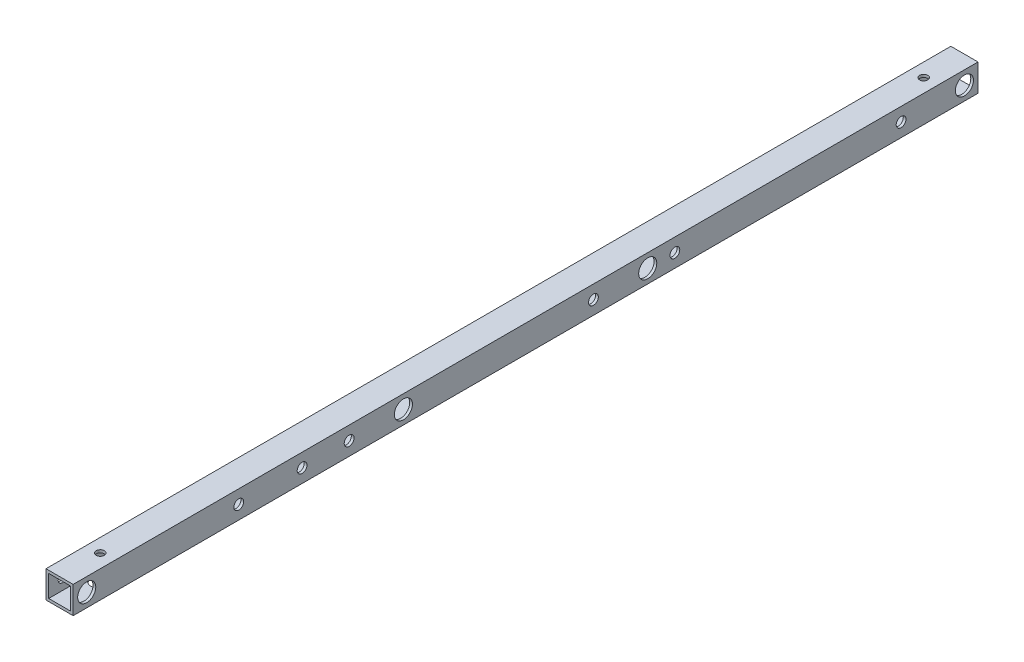
ISO-10303-21;
HEADER;
FILE_DESCRIPTION(('STEP AP214'),'2;1');
FILE_NAME('part.step','',(''),(''),'','','');
FILE_SCHEMA(('AUTOMOTIVE_DESIGN { 1 0 10303 214 1 1 1 1 }'));
ENDSEC;
DATA;
#1=APPLICATION_CONTEXT('core data for automotive mechanical design processes');
#2=APPLICATION_PROTOCOL_DEFINITION('international standard','automotive_design',2000,#1);
#3=PRODUCT_CONTEXT('',#1,'mechanical');
#4=PRODUCT('Part','Part','',(#3));
#5=PRODUCT_RELATED_PRODUCT_CATEGORY('part','',(#4));
#6=PRODUCT_DEFINITION_FORMATION('','',#4);
#7=PRODUCT_DEFINITION_CONTEXT('part definition',#1,'design');
#8=PRODUCT_DEFINITION('design','',#6,#7);
#9=PRODUCT_DEFINITION_SHAPE('','',#8);
#10=(LENGTH_UNIT() NAMED_UNIT(*) SI_UNIT(.MILLI.,.METRE.));
#11=(NAMED_UNIT(*) PLANE_ANGLE_UNIT() SI_UNIT($,.RADIAN.));
#12=(NAMED_UNIT(*) SI_UNIT($,.STERADIAN.) SOLID_ANGLE_UNIT());
#13=UNCERTAINTY_MEASURE_WITH_UNIT(LENGTH_MEASURE(1.E-05),#10,'distance_accuracy_value','');
#14=(GEOMETRIC_REPRESENTATION_CONTEXT(3) GLOBAL_UNCERTAINTY_ASSIGNED_CONTEXT((#13)) GLOBAL_UNIT_ASSIGNED_CONTEXT((#10,
#11,#12)) REPRESENTATION_CONTEXT('',''));
#15=CARTESIAN_POINT('',(0.,0.,0.));
#16=DIRECTION('',(0.,0.,1.));
#17=DIRECTION('',(1.,0.,0.));
#18=AXIS2_PLACEMENT_3D('',#15,#16,#17);
#19=CARTESIAN_POINT('',(-6.,-6.,500.));
#20=DIRECTION('',(1.,0.,0.));
#21=DIRECTION('',(0.,0.,-1.));
#22=AXIS2_PLACEMENT_3D('',#19,#20,#21);
#23=PLANE('',#22);
#24=CARTESIAN_POINT('',(-6.,0.,212.5));
#25=DIRECTION('',(1.,0.,0.));
#26=DIRECTION('',(0.,0.,-1.));
#27=AXIS2_PLACEMENT_3D('',#24,#25,#26);
#28=CIRCLE('',#27,4.99999999999999);
#29=CARTESIAN_POINT('',(-6.,0.,207.5));
#30=VERTEX_POINT('',#29);
#31=EDGE_CURVE('E691',#30,#30,#28,.F.);
#32=ORIENTED_EDGE('',*,*,#31,.T.);
#33=EDGE_LOOP('',(#32));
#34=FACE_BOUND('',#33,.T.);
#35=DIRECTION('',(0.,-1.,0.));
#36=VECTOR('',#35,1.);
#37=CARTESIAN_POINT('',(-6.,-6.,0.));
#38=LINE('',#37,#36);
#39=CARTESIAN_POINT('',(-6.,6.,0.));
#40=VERTEX_POINT('',#39);
#41=CARTESIAN_POINT('',(-6.,-6.,0.));
#42=VERTEX_POINT('',#41);
#43=EDGE_CURVE('E150',#40,#42,#38,.T.);
#44=ORIENTED_EDGE('',*,*,#43,.F.);
#45=DIRECTION('',(0.,0.,-1.));
#46=VECTOR('',#45,1.);
#47=CARTESIAN_POINT('',(-6.,6.,500.));
#48=LINE('',#47,#46);
#49=CARTESIAN_POINT('',(-6.,6.,500.));
#50=VERTEX_POINT('',#49);
#51=EDGE_CURVE('E130',#50,#40,#48,.T.);
#52=ORIENTED_EDGE('',*,*,#51,.F.);
#53=DIRECTION('',(0.,-1.,0.));
#54=VECTOR('',#53,1.);
#55=CARTESIAN_POINT('',(-6.,-6.,500.));
#56=LINE('',#55,#54);
#57=CARTESIAN_POINT('',(-6.,-6.,500.));
#58=VERTEX_POINT('',#57);
#59=EDGE_CURVE('E134',#50,#58,#56,.T.);
#60=ORIENTED_EDGE('',*,*,#59,.T.);
#61=DIRECTION('',(0.,0.,-1.));
#62=VECTOR('',#61,1.);
#63=CARTESIAN_POINT('',(-6.,-6.,500.));
#64=LINE('',#63,#62);
#65=EDGE_CURVE('E61',#58,#42,#64,.T.);
#66=ORIENTED_EDGE('',*,*,#65,.T.);
#67=EDGE_LOOP('',(#44,#52,#60,#66));
#68=FACE_BOUND('',#67,.T.);
#69=CARTESIAN_POINT('',(-6.,0.,7.5));
#70=DIRECTION('',(1.,0.,0.));
#71=DIRECTION('',(0.,0.,-1.));
#72=AXIS2_PLACEMENT_3D('',#69,#70,#71);
#73=CIRCLE('',#72,2.25);
#74=CARTESIAN_POINT('',(-6.,0.,5.25));
#75=VERTEX_POINT('',#74);
#76=EDGE_CURVE('E199',#75,#75,#73,.T.);
#77=ORIENTED_EDGE('',*,*,#76,.F.);
#78=EDGE_LOOP('',(#77));
#79=FACE_BOUND('',#78,.T.);
#80=CARTESIAN_POINT('',(-6.,0.,182.5));
#81=DIRECTION('',(1.,0.,0.));
#82=DIRECTION('',(0.,0.,-1.));
#83=AXIS2_PLACEMENT_3D('',#80,#81,#82);
#84=CIRCLE('',#83,2.25000000000001);
#85=CARTESIAN_POINT('',(-6.,0.,180.25));
#86=VERTEX_POINT('',#85);
#87=EDGE_CURVE('E205',#86,#86,#84,.T.);
#88=ORIENTED_EDGE('',*,*,#87,.F.);
#89=EDGE_LOOP('',(#88));
#90=FACE_BOUND('',#89,.T.);
#91=CARTESIAN_POINT('',(-6.,0.,317.5));
#92=DIRECTION('',(1.,0.,0.));
#93=DIRECTION('',(0.,0.,-1.));
#94=AXIS2_PLACEMENT_3D('',#91,#92,#93);
#95=CIRCLE('',#94,2.24999999999995);
#96=CARTESIAN_POINT('',(-6.,0.,315.25));
#97=VERTEX_POINT('',#96);
#98=EDGE_CURVE('E210',#97,#97,#95,.T.);
#99=ORIENTED_EDGE('',*,*,#98,.F.);
#100=EDGE_LOOP('',(#99));
#101=FACE_BOUND('',#100,.T.);
#102=CARTESIAN_POINT('',(-6.,0.,492.5));
#103=DIRECTION('',(1.,0.,0.));
#104=DIRECTION('',(0.,0.,-1.));
#105=AXIS2_PLACEMENT_3D('',#102,#103,#104);
#106=CIRCLE('',#105,2.24999999999995);
#107=CARTESIAN_POINT('',(-6.,0.,490.25));
#108=VERTEX_POINT('',#107);
#109=EDGE_CURVE('E215',#108,#108,#106,.T.);
#110=ORIENTED_EDGE('',*,*,#109,.F.);
#111=EDGE_LOOP('',(#110));
#112=FACE_BOUND('',#111,.T.);
#113=CARTESIAN_POINT('',(-6.,0.,408.5));
#114=DIRECTION('',(1.,0.,0.));
#115=DIRECTION('',(0.,0.,-1.));
#116=AXIS2_PLACEMENT_3D('',#113,#114,#115);
#117=CIRCLE('',#116,4.99999999999999);
#118=CARTESIAN_POINT('',(-6.,0.,403.5));
#119=VERTEX_POINT('',#118);
#120=EDGE_CURVE('E722',#119,#119,#117,.F.);
#121=ORIENTED_EDGE('',*,*,#120,.T.);
#122=EDGE_LOOP('',(#121));
#123=FACE_BOUND('',#122,.T.);
#124=CARTESIAN_POINT('',(-6.,0.,373.5));
#125=DIRECTION('',(1.,0.,0.));
#126=DIRECTION('',(0.,0.,-1.));
#127=AXIS2_PLACEMENT_3D('',#124,#125,#126);
#128=CIRCLE('',#127,4.99999999999999);
#129=CARTESIAN_POINT('',(-6.,0.,368.5));
#130=VERTEX_POINT('',#129);
#131=EDGE_CURVE('E714',#130,#130,#128,.F.);
#132=ORIENTED_EDGE('',*,*,#131,.T.);
#133=EDGE_LOOP('',(#132));
#134=FACE_BOUND('',#133,.T.);
#135=CARTESIAN_POINT('',(-6.,0.,42.5));
#136=DIRECTION('',(1.,0.,0.));
#137=DIRECTION('',(0.,0.,-1.));
#138=AXIS2_PLACEMENT_3D('',#135,#136,#137);
#139=CIRCLE('',#138,4.99999999999999);
#140=CARTESIAN_POINT('',(-6.,0.,37.5));
#141=VERTEX_POINT('',#140);
#142=EDGE_CURVE('E706',#141,#141,#139,.F.);
#143=ORIENTED_EDGE('',*,*,#142,.T.);
#144=EDGE_LOOP('',(#143));
#145=FACE_BOUND('',#144,.T.);
#146=CARTESIAN_POINT('',(-6.,0.,167.5));
#147=DIRECTION('',(1.,0.,0.));
#148=DIRECTION('',(0.,0.,-1.));
#149=AXIS2_PLACEMENT_3D('',#146,#147,#148);
#150=CIRCLE('',#149,4.99999999999999);
#151=CARTESIAN_POINT('',(-6.,0.,162.5));
#152=VERTEX_POINT('',#151);
#153=EDGE_CURVE('E698',#152,#152,#150,.F.);
#154=ORIENTED_EDGE('',*,*,#153,.T.);
#155=EDGE_LOOP('',(#154));
#156=FACE_BOUND('',#155,.T.);
#157=CARTESIAN_POINT('',(-6.,0.,347.5));
#158=DIRECTION('',(1.,0.,0.));
#159=DIRECTION('',(0.,0.,-1.));
#160=AXIS2_PLACEMENT_3D('',#157,#158,#159);
#161=CIRCLE('',#160,4.99999999999999);
#162=CARTESIAN_POINT('',(-6.,0.,342.5));
#163=VERTEX_POINT('',#162);
#164=EDGE_CURVE('E677',#163,#163,#161,.F.);
#165=ORIENTED_EDGE('',*,*,#164,.T.);
#166=EDGE_LOOP('',(#165));
#167=FACE_BOUND('',#166,.T.);
#168=ADVANCED_FACE('F43',(#34,#68,#79,#90,#101,#112,#123,#134,#145,#156,#167),#23,.T.);
#169=CARTESIAN_POINT('',(0.,0.,500.));
#170=DIRECTION('',(0.,0.,-1.));
#171=DIRECTION('',(-1.,0.,0.));
#172=AXIS2_PLACEMENT_3D('',#169,#170,#171);
#173=PLANE('',#172);
#174=DIRECTION('',(0.,1.,0.));
#175=VECTOR('',#174,1.);
#176=CARTESIAN_POINT('',(7.5,-7.5,500.));
#177=LINE('',#176,#175);
#178=CARTESIAN_POINT('',(7.5,-7.5,500.));
#179=VERTEX_POINT('',#178);
#180=CARTESIAN_POINT('',(7.5,7.5,500.));
#181=VERTEX_POINT('',#180);
#182=EDGE_CURVE('E163',#179,#181,#177,.T.);
#183=ORIENTED_EDGE('',*,*,#182,.T.);
#184=DIRECTION('',(-1.,0.,0.));
#185=VECTOR('',#184,1.);
#186=CARTESIAN_POINT('',(-7.5,7.5,500.));
#187=LINE('',#186,#185);
#188=CARTESIAN_POINT('',(-7.5,7.5,500.));
#189=VERTEX_POINT('',#188);
#190=EDGE_CURVE('E167',#181,#189,#187,.T.);
#191=ORIENTED_EDGE('',*,*,#190,.T.);
#192=DIRECTION('',(0.,-1.,0.));
#193=VECTOR('',#192,1.);
#194=CARTESIAN_POINT('',(-7.5,-7.5,500.));
#195=LINE('',#194,#193);
#196=CARTESIAN_POINT('',(-7.5,-7.5,500.));
#197=VERTEX_POINT('',#196);
#198=EDGE_CURVE('E171',#189,#197,#195,.T.);
#199=ORIENTED_EDGE('',*,*,#198,.T.);
#200=DIRECTION('',(1.,0.,0.));
#201=VECTOR('',#200,1.);
#202=CARTESIAN_POINT('',(-7.5,-7.5,500.));
#203=LINE('',#202,#201);
#204=EDGE_CURVE('E174',#197,#179,#203,.T.);
#205=ORIENTED_EDGE('',*,*,#204,.T.);
#206=EDGE_LOOP('',(#183,#191,#199,#205));
#207=FACE_BOUND('',#206,.T.);
#208=DIRECTION('',(0.,1.,0.));
#209=VECTOR('',#208,1.);
#210=CARTESIAN_POINT('',(6.,-6.,500.));
#211=LINE('',#210,#209);
#212=CARTESIAN_POINT('',(6.,-6.,500.));
#213=VERTEX_POINT('',#212);
#214=CARTESIAN_POINT('',(6.,6.,500.));
#215=VERTEX_POINT('',#214);
#216=EDGE_CURVE('E111',#213,#215,#211,.T.);
#217=ORIENTED_EDGE('',*,*,#216,.F.);
#218=DIRECTION('',(1.,0.,0.));
#219=VECTOR('',#218,1.);
#220=CARTESIAN_POINT('',(-6.,-6.,500.));
#221=LINE('',#220,#219);
#222=EDGE_CURVE('E139',#58,#213,#221,.T.);
#223=ORIENTED_EDGE('',*,*,#222,.F.);
#224=ORIENTED_EDGE('',*,*,#59,.F.);
#225=DIRECTION('',(-1.,0.,0.));
#226=VECTOR('',#225,1.);
#227=CARTESIAN_POINT('',(-6.,6.,500.));
#228=LINE('',#227,#226);
#229=EDGE_CURVE('E120',#215,#50,#228,.T.);
#230=ORIENTED_EDGE('',*,*,#229,.F.);
#231=EDGE_LOOP('',(#217,#223,#224,#230));
#232=FACE_BOUND('',#231,.T.);
#233=ADVANCED_FACE('F133',(#207,#232),#173,.F.);
#234=CARTESIAN_POINT('',(0.,0.,0.));
#235=DIRECTION('',(0.,0.,-1.));
#236=DIRECTION('',(-1.,0.,0.));
#237=AXIS2_PLACEMENT_3D('',#234,#235,#236);
#238=PLANE('',#237);
#239=DIRECTION('',(0.,1.,0.));
#240=VECTOR('',#239,1.);
#241=CARTESIAN_POINT('',(7.5,-7.5,0.));
#242=LINE('',#241,#240);
#243=CARTESIAN_POINT('',(7.5,-7.5,0.));
#244=VERTEX_POINT('',#243);
#245=CARTESIAN_POINT('',(7.5,7.5,0.));
#246=VERTEX_POINT('',#245);
#247=EDGE_CURVE('E129',#244,#246,#242,.T.);
#248=ORIENTED_EDGE('',*,*,#247,.F.);
#249=DIRECTION('',(1.,0.,0.));
#250=VECTOR('',#249,1.);
#251=CARTESIAN_POINT('',(-7.5,-7.5,0.));
#252=LINE('',#251,#250);
#253=CARTESIAN_POINT('',(-7.5,-7.5,0.));
#254=VERTEX_POINT('',#253);
#255=EDGE_CURVE('E168',#254,#244,#252,.T.);
#256=ORIENTED_EDGE('',*,*,#255,.F.);
#257=DIRECTION('',(0.,-1.,0.));
#258=VECTOR('',#257,1.);
#259=CARTESIAN_POINT('',(-7.5,-7.5,0.));
#260=LINE('',#259,#258);
#261=CARTESIAN_POINT('',(-7.5,7.5,0.));
#262=VERTEX_POINT('',#261);
#263=EDGE_CURVE('E184',#262,#254,#260,.T.);
#264=ORIENTED_EDGE('',*,*,#263,.F.);
#265=DIRECTION('',(-1.,0.,0.));
#266=VECTOR('',#265,1.);
#267=CARTESIAN_POINT('',(-7.5,7.5,0.));
#268=LINE('',#267,#266);
#269=EDGE_CURVE('E181',#246,#262,#268,.T.);
#270=ORIENTED_EDGE('',*,*,#269,.F.);
#271=EDGE_LOOP('',(#248,#256,#264,#270));
#272=FACE_BOUND('',#271,.T.);
#273=DIRECTION('',(1.,0.,0.));
#274=VECTOR('',#273,1.);
#275=CARTESIAN_POINT('',(-6.,-6.,0.));
#276=LINE('',#275,#274);
#277=CARTESIAN_POINT('',(6.,-6.,0.));
#278=VERTEX_POINT('',#277);
#279=EDGE_CURVE('E121',#42,#278,#276,.T.);
#280=ORIENTED_EDGE('',*,*,#279,.T.);
#281=DIRECTION('',(0.,1.,0.));
#282=VECTOR('',#281,1.);
#283=CARTESIAN_POINT('',(6.,-6.,0.));
#284=LINE('',#283,#282);
#285=CARTESIAN_POINT('',(6.,6.,0.));
#286=VERTEX_POINT('',#285);
#287=EDGE_CURVE('E69',#278,#286,#284,.T.);
#288=ORIENTED_EDGE('',*,*,#287,.T.);
#289=DIRECTION('',(-1.,0.,0.));
#290=VECTOR('',#289,1.);
#291=CARTESIAN_POINT('',(-6.,6.,0.));
#292=LINE('',#291,#290);
#293=EDGE_CURVE('E127',#286,#40,#292,.T.);
#294=ORIENTED_EDGE('',*,*,#293,.T.);
#295=ORIENTED_EDGE('',*,*,#43,.T.);
#296=EDGE_LOOP('',(#280,#288,#294,#295));
#297=FACE_BOUND('',#296,.T.);
#298=ADVANCED_FACE('F366',(#272,#297),#238,.T.);
#299=CARTESIAN_POINT('',(7.5,-7.5,500.));
#300=DIRECTION('',(-1.,0.,0.));
#301=DIRECTION('',(0.,0.,1.));
#302=AXIS2_PLACEMENT_3D('',#299,#300,#301);
#303=PLANE('',#302);
#304=CARTESIAN_POINT('',(7.5,0.,347.5));
#305=DIRECTION('',(1.,0.,0.));
#306=DIRECTION('',(0.,0.,-1.));
#307=AXIS2_PLACEMENT_3D('',#304,#305,#306);
#308=CIRCLE('',#307,2.7);
#309=CARTESIAN_POINT('',(7.5,0.,344.8));
#310=VERTEX_POINT('',#309);
#311=EDGE_CURVE('E726',#310,#310,#308,.T.);
#312=ORIENTED_EDGE('',*,*,#311,.F.);
#313=EDGE_LOOP('',(#312));
#314=FACE_BOUND('',#313,.T.);
#315=CARTESIAN_POINT('',(7.5,0.,212.5));
#316=DIRECTION('',(1.,0.,0.));
#317=DIRECTION('',(0.,0.,-1.));
#318=AXIS2_PLACEMENT_3D('',#315,#316,#317);
#319=CIRCLE('',#318,2.7);
#320=CARTESIAN_POINT('',(7.5,0.,209.8));
#321=VERTEX_POINT('',#320);
#322=EDGE_CURVE('E267',#321,#321,#319,.T.);
#323=ORIENTED_EDGE('',*,*,#322,.F.);
#324=EDGE_LOOP('',(#323));
#325=FACE_BOUND('',#324,.T.);
#326=CARTESIAN_POINT('',(7.5,0.,167.5));
#327=DIRECTION('',(1.,0.,0.));
#328=DIRECTION('',(0.,0.,-1.));
#329=AXIS2_PLACEMENT_3D('',#326,#327,#328);
#330=CIRCLE('',#329,2.7);
#331=CARTESIAN_POINT('',(7.5,0.,164.8));
#332=VERTEX_POINT('',#331);
#333=EDGE_CURVE('E250',#332,#332,#330,.T.);
#334=ORIENTED_EDGE('',*,*,#333,.F.);
#335=EDGE_LOOP('',(#334));
#336=FACE_BOUND('',#335,.T.);
#337=CARTESIAN_POINT('',(7.5,0.,42.5));
#338=DIRECTION('',(1.,0.,0.));
#339=DIRECTION('',(0.,0.,-1.));
#340=AXIS2_PLACEMENT_3D('',#337,#338,#339);
#341=CIRCLE('',#340,2.7);
#342=CARTESIAN_POINT('',(7.5,0.,39.8));
#343=VERTEX_POINT('',#342);
#344=EDGE_CURVE('E249',#343,#343,#341,.T.);
#345=ORIENTED_EDGE('',*,*,#344,.F.);
#346=EDGE_LOOP('',(#345));
#347=FACE_BOUND('',#346,.T.);
#348=CARTESIAN_POINT('',(7.5,0.,373.5));
#349=DIRECTION('',(1.,0.,0.));
#350=DIRECTION('',(0.,0.,-1.));
#351=AXIS2_PLACEMENT_3D('',#348,#349,#350);
#352=CIRCLE('',#351,2.7);
#353=CARTESIAN_POINT('',(7.5,0.,370.8));
#354=VERTEX_POINT('',#353);
#355=EDGE_CURVE('E274',#354,#354,#352,.T.);
#356=ORIENTED_EDGE('',*,*,#355,.F.);
#357=EDGE_LOOP('',(#356));
#358=FACE_BOUND('',#357,.T.);
#359=CARTESIAN_POINT('',(7.5,0.,408.5));
#360=DIRECTION('',(1.,0.,0.));
#361=DIRECTION('',(0.,0.,-1.));
#362=AXIS2_PLACEMENT_3D('',#359,#360,#361);
#363=CIRCLE('',#362,2.7);
#364=CARTESIAN_POINT('',(7.5,0.,405.8));
#365=VERTEX_POINT('',#364);
#366=EDGE_CURVE('E282',#365,#365,#363,.T.);
#367=ORIENTED_EDGE('',*,*,#366,.F.);
#368=EDGE_LOOP('',(#367));
#369=FACE_BOUND('',#368,.T.);
#370=CARTESIAN_POINT('',(7.5,0.,492.5));
#371=DIRECTION('',(1.,0.,0.));
#372=DIRECTION('',(0.,0.,-1.));
#373=AXIS2_PLACEMENT_3D('',#370,#371,#372);
#374=CIRCLE('',#373,4.99999999999999);
#375=CARTESIAN_POINT('',(7.5,0.,487.5));
#376=VERTEX_POINT('',#375);
#377=EDGE_CURVE('E224',#376,#376,#374,.T.);
#378=ORIENTED_EDGE('',*,*,#377,.F.);
#379=EDGE_LOOP('',(#378));
#380=FACE_BOUND('',#379,.T.);
#381=CARTESIAN_POINT('',(7.5,0.,7.5));
#382=DIRECTION('',(1.,0.,0.));
#383=DIRECTION('',(0.,0.,-1.));
#384=AXIS2_PLACEMENT_3D('',#381,#382,#383);
#385=CIRCLE('',#384,5.);
#386=CARTESIAN_POINT('',(7.5,0.,2.5));
#387=VERTEX_POINT('',#386);
#388=EDGE_CURVE('E300',#387,#387,#385,.T.);
#389=ORIENTED_EDGE('',*,*,#388,.F.);
#390=EDGE_LOOP('',(#389));
#391=FACE_BOUND('',#390,.T.);
#392=CARTESIAN_POINT('',(7.5,0.,182.5));
#393=DIRECTION('',(1.,0.,0.));
#394=DIRECTION('',(0.,0.,-1.));
#395=AXIS2_PLACEMENT_3D('',#392,#393,#394);
#396=CIRCLE('',#395,4.99999999999999);
#397=CARTESIAN_POINT('',(7.5,0.,177.5));
#398=VERTEX_POINT('',#397);
#399=EDGE_CURVE('E304',#398,#398,#396,.T.);
#400=ORIENTED_EDGE('',*,*,#399,.F.);
#401=EDGE_LOOP('',(#400));
#402=FACE_BOUND('',#401,.T.);
#403=CARTESIAN_POINT('',(7.5,0.,317.5));
#404=DIRECTION('',(1.,0.,0.));
#405=DIRECTION('',(0.,0.,-1.));
#406=AXIS2_PLACEMENT_3D('',#403,#404,#405);
#407=CIRCLE('',#406,4.99999999999999);
#408=CARTESIAN_POINT('',(7.5,0.,312.5));
#409=VERTEX_POINT('',#408);
#410=EDGE_CURVE('E245',#409,#409,#407,.T.);
#411=ORIENTED_EDGE('',*,*,#410,.F.);
#412=EDGE_LOOP('',(#411));
#413=FACE_BOUND('',#412,.T.);
#414=ORIENTED_EDGE('',*,*,#247,.T.);
#415=DIRECTION('',(0.,0.,-1.));
#416=VECTOR('',#415,1.);
#417=CARTESIAN_POINT('',(7.5,7.5,500.));
#418=LINE('',#417,#416);
#419=EDGE_CURVE('E11',#181,#246,#418,.T.);
#420=ORIENTED_EDGE('',*,*,#419,.F.);
#421=ORIENTED_EDGE('',*,*,#182,.F.);
#422=DIRECTION('',(0.,0.,-1.));
#423=VECTOR('',#422,1.);
#424=CARTESIAN_POINT('',(7.5,-7.5,500.));
#425=LINE('',#424,#423);
#426=EDGE_CURVE('E177',#179,#244,#425,.T.);
#427=ORIENTED_EDGE('',*,*,#426,.T.);
#428=EDGE_LOOP('',(#414,#420,#421,#427));
#429=FACE_BOUND('',#428,.T.);
#430=ADVANCED_FACE('F45',(#314,#325,#336,#347,#358,#369,#380,#391,#402,#413,#429),#303,.F.);
#431=CARTESIAN_POINT('',(-7.5,7.5,500.));
#432=DIRECTION('',(0.,-1.,0.));
#433=DIRECTION('',(0.,0.,-1.));
#434=AXIS2_PLACEMENT_3D('',#431,#432,#433);
#435=PLANE('',#434);
#436=CARTESIAN_POINT('',(9.26342336171615E-13,7.5,22.5));
#437=DIRECTION('',(0.,-1.,0.));
#438=DIRECTION('',(0.,0.,-1.));
#439=AXIS2_PLACEMENT_3D('',#436,#437,#438);
#440=CIRCLE('',#439,2.25);
#441=CARTESIAN_POINT('',(9.26342336171615E-13,7.5,20.25));
#442=VERTEX_POINT('',#441);
#443=EDGE_CURVE('E204',#442,#442,#440,.T.);
#444=ORIENTED_EDGE('',*,*,#443,.T.);
#445=EDGE_LOOP('',(#444));
#446=FACE_BOUND('',#445,.T.);
#447=CARTESIAN_POINT('',(0.,7.5,477.5));
#448=DIRECTION('',(0.,-1.,0.));
#449=DIRECTION('',(0.,0.,-1.));
#450=AXIS2_PLACEMENT_3D('',#447,#448,#449);
#451=CIRCLE('',#450,2.25);
#452=CARTESIAN_POINT('',(0.,7.5,475.25));
#453=VERTEX_POINT('',#452);
#454=EDGE_CURVE('E314',#453,#453,#451,.T.);
#455=ORIENTED_EDGE('',*,*,#454,.T.);
#456=EDGE_LOOP('',(#455));
#457=FACE_BOUND('',#456,.T.);
#458=ORIENTED_EDGE('',*,*,#269,.T.);
#459=DIRECTION('',(0.,0.,-1.));
#460=VECTOR('',#459,1.);
#461=CARTESIAN_POINT('',(-7.5,7.5,500.));
#462=LINE('',#461,#460);
#463=EDGE_CURVE('E53',#189,#262,#462,.T.);
#464=ORIENTED_EDGE('',*,*,#463,.F.);
#465=ORIENTED_EDGE('',*,*,#190,.F.);
#466=ORIENTED_EDGE('',*,*,#419,.T.);
#467=EDGE_LOOP('',(#458,#464,#465,#466));
#468=FACE_BOUND('',#467,.T.);
#469=ADVANCED_FACE('F388',(#446,#457,#468),#435,.F.);
#470=CARTESIAN_POINT('',(-7.5,-7.5,500.));
#471=DIRECTION('',(1.,0.,0.));
#472=DIRECTION('',(0.,0.,-1.));
#473=AXIS2_PLACEMENT_3D('',#470,#471,#472);
#474=PLANE('',#473);
#475=CARTESIAN_POINT('',(-7.5,0.,347.5));
#476=DIRECTION('',(-1.,0.,0.));
#477=DIRECTION('',(0.,0.,1.));
#478=AXIS2_PLACEMENT_3D('',#475,#476,#477);
#479=CIRCLE('',#478,4.99999999999999);
#480=CARTESIAN_POINT('',(-7.5,0.,352.5));
#481=VERTEX_POINT('',#480);
#482=EDGE_CURVE('E680',#481,#481,#479,.T.);
#483=ORIENTED_EDGE('',*,*,#482,.F.);
#484=EDGE_LOOP('',(#483));
#485=FACE_BOUND('',#484,.T.);
#486=CARTESIAN_POINT('',(-7.5,0.,212.5));
#487=DIRECTION('',(-1.,0.,0.));
#488=DIRECTION('',(0.,0.,1.));
#489=AXIS2_PLACEMENT_3D('',#486,#487,#488);
#490=CIRCLE('',#489,4.99999999999999);
#491=CARTESIAN_POINT('',(-7.5,0.,217.5));
#492=VERTEX_POINT('',#491);
#493=EDGE_CURVE('E685',#492,#492,#490,.T.);
#494=ORIENTED_EDGE('',*,*,#493,.F.);
#495=EDGE_LOOP('',(#494));
#496=FACE_BOUND('',#495,.T.);
#497=CARTESIAN_POINT('',(-7.5,0.,167.5));
#498=DIRECTION('',(-1.,0.,0.));
#499=DIRECTION('',(0.,0.,1.));
#500=AXIS2_PLACEMENT_3D('',#497,#498,#499);
#501=CIRCLE('',#500,4.99999999999999);
#502=CARTESIAN_POINT('',(-7.5,0.,172.5));
#503=VERTEX_POINT('',#502);
#504=EDGE_CURVE('E694',#503,#503,#501,.T.);
#505=ORIENTED_EDGE('',*,*,#504,.F.);
#506=EDGE_LOOP('',(#505));
#507=FACE_BOUND('',#506,.T.);
#508=CARTESIAN_POINT('',(-7.5,0.,42.5));
#509=DIRECTION('',(-1.,0.,0.));
#510=DIRECTION('',(0.,0.,1.));
#511=AXIS2_PLACEMENT_3D('',#508,#509,#510);
#512=CIRCLE('',#511,4.99999999999999);
#513=CARTESIAN_POINT('',(-7.5,0.,47.5));
#514=VERTEX_POINT('',#513);
#515=EDGE_CURVE('E702',#514,#514,#512,.T.);
#516=ORIENTED_EDGE('',*,*,#515,.F.);
#517=EDGE_LOOP('',(#516));
#518=FACE_BOUND('',#517,.T.);
#519=CARTESIAN_POINT('',(-7.5,0.,373.5));
#520=DIRECTION('',(-1.,0.,0.));
#521=DIRECTION('',(0.,0.,1.));
#522=AXIS2_PLACEMENT_3D('',#519,#520,#521);
#523=CIRCLE('',#522,4.99999999999999);
#524=CARTESIAN_POINT('',(-7.5,0.,378.5));
#525=VERTEX_POINT('',#524);
#526=EDGE_CURVE('E710',#525,#525,#523,.T.);
#527=ORIENTED_EDGE('',*,*,#526,.F.);
#528=EDGE_LOOP('',(#527));
#529=FACE_BOUND('',#528,.T.);
#530=CARTESIAN_POINT('',(-7.5,0.,408.5));
#531=DIRECTION('',(-1.,0.,0.));
#532=DIRECTION('',(0.,0.,1.));
#533=AXIS2_PLACEMENT_3D('',#530,#531,#532);
#534=CIRCLE('',#533,4.99999999999999);
#535=CARTESIAN_POINT('',(-7.5,0.,413.5));
#536=VERTEX_POINT('',#535);
#537=EDGE_CURVE('E718',#536,#536,#534,.T.);
#538=ORIENTED_EDGE('',*,*,#537,.F.);
#539=EDGE_LOOP('',(#538));
#540=FACE_BOUND('',#539,.T.);
#541=CARTESIAN_POINT('',(-7.5,0.,492.5));
#542=DIRECTION('',(1.,0.,0.));
#543=DIRECTION('',(0.,0.,-1.));
#544=AXIS2_PLACEMENT_3D('',#541,#542,#543);
#545=CIRCLE('',#544,2.24999999999995);
#546=CARTESIAN_POINT('',(-7.5,0.,490.25));
#547=VERTEX_POINT('',#546);
#548=EDGE_CURVE('E147',#547,#547,#545,.T.);
#549=ORIENTED_EDGE('',*,*,#548,.T.);
#550=EDGE_LOOP('',(#549));
#551=FACE_BOUND('',#550,.T.);
#552=CARTESIAN_POINT('',(-7.5,0.,317.5));
#553=DIRECTION('',(1.,0.,0.));
#554=DIRECTION('',(0.,0.,-1.));
#555=AXIS2_PLACEMENT_3D('',#552,#553,#554);
#556=CIRCLE('',#555,2.24999999999995);
#557=CARTESIAN_POINT('',(-7.5,0.,315.25));
#558=VERTEX_POINT('',#557);
#559=EDGE_CURVE('E214',#558,#558,#556,.T.);
#560=ORIENTED_EDGE('',*,*,#559,.T.);
#561=EDGE_LOOP('',(#560));
#562=FACE_BOUND('',#561,.T.);
#563=CARTESIAN_POINT('',(-7.5,0.,182.5));
#564=DIRECTION('',(1.,0.,0.));
#565=DIRECTION('',(0.,0.,-1.));
#566=AXIS2_PLACEMENT_3D('',#563,#564,#565);
#567=CIRCLE('',#566,2.25000000000001);
#568=CARTESIAN_POINT('',(-7.5,0.,180.25));
#569=VERTEX_POINT('',#568);
#570=EDGE_CURVE('E209',#569,#569,#567,.T.);
#571=ORIENTED_EDGE('',*,*,#570,.T.);
#572=EDGE_LOOP('',(#571));
#573=FACE_BOUND('',#572,.T.);
#574=CARTESIAN_POINT('',(-7.5,0.,7.5));
#575=DIRECTION('',(1.,0.,0.));
#576=DIRECTION('',(0.,0.,-1.));
#577=AXIS2_PLACEMENT_3D('',#574,#575,#576);
#578=CIRCLE('',#577,2.25);
#579=CARTESIAN_POINT('',(-7.5,0.,5.25));
#580=VERTEX_POINT('',#579);
#581=EDGE_CURVE('E203',#580,#580,#578,.T.);
#582=ORIENTED_EDGE('',*,*,#581,.T.);
#583=EDGE_LOOP('',(#582));
#584=FACE_BOUND('',#583,.T.);
#585=ORIENTED_EDGE('',*,*,#263,.T.);
#586=DIRECTION('',(0.,0.,-1.));
#587=VECTOR('',#586,1.);
#588=CARTESIAN_POINT('',(-7.5,-7.5,500.));
#589=LINE('',#588,#587);
#590=EDGE_CURVE('E192',#197,#254,#589,.T.);
#591=ORIENTED_EDGE('',*,*,#590,.F.);
#592=ORIENTED_EDGE('',*,*,#198,.F.);
#593=ORIENTED_EDGE('',*,*,#463,.T.);
#594=EDGE_LOOP('',(#585,#591,#592,#593));
#595=FACE_BOUND('',#594,.T.);
#596=ADVANCED_FACE('F338',(#485,#496,#507,#518,#529,#540,#551,#562,#573,#584,#595),#474,.F.);
#597=CARTESIAN_POINT('',(-7.5,-7.5,500.));
#598=DIRECTION('',(0.,1.,0.));
#599=DIRECTION('',(0.,0.,1.));
#600=AXIS2_PLACEMENT_3D('',#597,#598,#599);
#601=PLANE('',#600);
#602=CARTESIAN_POINT('',(9.26342336171615E-13,-7.5,22.5));
#603=DIRECTION('',(0.,1.,0.));
#604=DIRECTION('',(0.,0.,1.));
#605=AXIS2_PLACEMENT_3D('',#602,#603,#604);
#606=CIRCLE('',#605,5.);
#607=CARTESIAN_POINT('',(9.26342336171615E-13,-7.5,27.5));
#608=VERTEX_POINT('',#607);
#609=EDGE_CURVE('E242',#608,#608,#606,.T.);
#610=ORIENTED_EDGE('',*,*,#609,.T.);
#611=EDGE_LOOP('',(#610));
#612=FACE_BOUND('',#611,.T.);
#613=CARTESIAN_POINT('',(0.,-7.5,477.5));
#614=DIRECTION('',(0.,1.,0.));
#615=DIRECTION('',(0.,0.,1.));
#616=AXIS2_PLACEMENT_3D('',#613,#614,#615);
#617=CIRCLE('',#616,5.);
#618=CARTESIAN_POINT('',(0.,-7.5,482.5));
#619=VERTEX_POINT('',#618);
#620=EDGE_CURVE('E290',#619,#619,#617,.T.);
#621=ORIENTED_EDGE('',*,*,#620,.T.);
#622=EDGE_LOOP('',(#621));
#623=FACE_BOUND('',#622,.T.);
#624=ORIENTED_EDGE('',*,*,#255,.T.);
#625=ORIENTED_EDGE('',*,*,#426,.F.);
#626=ORIENTED_EDGE('',*,*,#204,.F.);
#627=ORIENTED_EDGE('',*,*,#590,.T.);
#628=EDGE_LOOP('',(#624,#625,#626,#627));
#629=FACE_BOUND('',#628,.T.);
#630=ADVANCED_FACE('F379',(#612,#623,#629),#601,.F.);
#631=CARTESIAN_POINT('',(6.,-6.,500.));
#632=DIRECTION('',(-1.,0.,0.));
#633=DIRECTION('',(0.,0.,1.));
#634=AXIS2_PLACEMENT_3D('',#631,#632,#633);
#635=PLANE('',#634);
#636=CARTESIAN_POINT('',(6.,0.,347.5));
#637=DIRECTION('',(-1.,0.,0.));
#638=DIRECTION('',(0.,0.,1.));
#639=AXIS2_PLACEMENT_3D('',#636,#637,#638);
#640=CIRCLE('',#639,2.7);
#641=CARTESIAN_POINT('',(6.,0.,350.2));
#642=VERTEX_POINT('',#641);
#643=EDGE_CURVE('E47',#642,#642,#640,.T.);
#644=ORIENTED_EDGE('',*,*,#643,.F.);
#645=EDGE_LOOP('',(#644));
#646=FACE_BOUND('',#645,.T.);
#647=CARTESIAN_POINT('',(6.,0.,212.5));
#648=DIRECTION('',(-1.,0.,0.));
#649=DIRECTION('',(0.,0.,1.));
#650=AXIS2_PLACEMENT_3D('',#647,#648,#649);
#651=CIRCLE('',#650,2.7);
#652=CARTESIAN_POINT('',(6.,0.,215.2));
#653=VERTEX_POINT('',#652);
#654=EDGE_CURVE('E260',#653,#653,#651,.T.);
#655=ORIENTED_EDGE('',*,*,#654,.F.);
#656=EDGE_LOOP('',(#655));
#657=FACE_BOUND('',#656,.T.);
#658=CARTESIAN_POINT('',(6.,0.,167.5));
#659=DIRECTION('',(-1.,0.,0.));
#660=DIRECTION('',(0.,0.,1.));
#661=AXIS2_PLACEMENT_3D('',#658,#659,#660);
#662=CIRCLE('',#661,2.7);
#663=CARTESIAN_POINT('',(6.,0.,170.2));
#664=VERTEX_POINT('',#663);
#665=EDGE_CURVE('E246',#664,#664,#662,.T.);
#666=ORIENTED_EDGE('',*,*,#665,.F.);
#667=EDGE_LOOP('',(#666));
#668=FACE_BOUND('',#667,.T.);
#669=CARTESIAN_POINT('',(6.,0.,42.5));
#670=DIRECTION('',(-1.,0.,0.));
#671=DIRECTION('',(0.,0.,1.));
#672=AXIS2_PLACEMENT_3D('',#669,#670,#671);
#673=CIRCLE('',#672,2.7);
#674=CARTESIAN_POINT('',(6.,0.,45.2));
#675=VERTEX_POINT('',#674);
#676=EDGE_CURVE('E257',#675,#675,#673,.T.);
#677=ORIENTED_EDGE('',*,*,#676,.F.);
#678=EDGE_LOOP('',(#677));
#679=FACE_BOUND('',#678,.T.);
#680=CARTESIAN_POINT('',(6.,0.,373.5));
#681=DIRECTION('',(-1.,0.,0.));
#682=DIRECTION('',(0.,0.,1.));
#683=AXIS2_PLACEMENT_3D('',#680,#681,#682);
#684=CIRCLE('',#683,2.7);
#685=CARTESIAN_POINT('',(6.,0.,376.2));
#686=VERTEX_POINT('',#685);
#687=EDGE_CURVE('E278',#686,#686,#684,.T.);
#688=ORIENTED_EDGE('',*,*,#687,.F.);
#689=EDGE_LOOP('',(#688));
#690=FACE_BOUND('',#689,.T.);
#691=CARTESIAN_POINT('',(6.,0.,408.5));
#692=DIRECTION('',(-1.,0.,0.));
#693=DIRECTION('',(0.,0.,1.));
#694=AXIS2_PLACEMENT_3D('',#691,#692,#693);
#695=CIRCLE('',#694,2.7);
#696=CARTESIAN_POINT('',(6.,0.,411.2));
#697=VERTEX_POINT('',#696);
#698=EDGE_CURVE('E286',#697,#697,#695,.T.);
#699=ORIENTED_EDGE('',*,*,#698,.F.);
#700=EDGE_LOOP('',(#699));
#701=FACE_BOUND('',#700,.T.);
#702=CARTESIAN_POINT('',(6.,0.,492.5));
#703=DIRECTION('',(-1.,0.,0.));
#704=DIRECTION('',(0.,0.,1.));
#705=AXIS2_PLACEMENT_3D('',#702,#703,#704);
#706=CIRCLE('',#705,4.99999999999999);
#707=CARTESIAN_POINT('',(6.,0.,497.5));
#708=VERTEX_POINT('',#707);
#709=EDGE_CURVE('E232',#708,#708,#706,.T.);
#710=ORIENTED_EDGE('',*,*,#709,.F.);
#711=EDGE_LOOP('',(#710));
#712=FACE_BOUND('',#711,.T.);
#713=CARTESIAN_POINT('',(6.,0.,7.5));
#714=DIRECTION('',(-1.,0.,0.));
#715=DIRECTION('',(0.,0.,1.));
#716=AXIS2_PLACEMENT_3D('',#713,#714,#715);
#717=CIRCLE('',#716,5.);
#718=CARTESIAN_POINT('',(6.,0.,12.5));
#719=VERTEX_POINT('',#718);
#720=EDGE_CURVE('E228',#719,#719,#717,.T.);
#721=ORIENTED_EDGE('',*,*,#720,.F.);
#722=EDGE_LOOP('',(#721));
#723=FACE_BOUND('',#722,.T.);
#724=CARTESIAN_POINT('',(6.,0.,182.5));
#725=DIRECTION('',(-1.,0.,0.));
#726=DIRECTION('',(0.,0.,1.));
#727=AXIS2_PLACEMENT_3D('',#724,#725,#726);
#728=CIRCLE('',#727,4.99999999999999);
#729=CARTESIAN_POINT('',(6.,0.,187.5));
#730=VERTEX_POINT('',#729);
#731=EDGE_CURVE('E223',#730,#730,#728,.T.);
#732=ORIENTED_EDGE('',*,*,#731,.F.);
#733=EDGE_LOOP('',(#732));
#734=FACE_BOUND('',#733,.T.);
#735=CARTESIAN_POINT('',(6.,0.,317.5));
#736=DIRECTION('',(-1.,0.,0.));
#737=DIRECTION('',(0.,0.,1.));
#738=AXIS2_PLACEMENT_3D('',#735,#736,#737);
#739=CIRCLE('',#738,4.99999999999999);
#740=CARTESIAN_POINT('',(6.,0.,322.5));
#741=VERTEX_POINT('',#740);
#742=EDGE_CURVE('E219',#741,#741,#739,.T.);
#743=ORIENTED_EDGE('',*,*,#742,.F.);
#744=EDGE_LOOP('',(#743));
#745=FACE_BOUND('',#744,.T.);
#746=ORIENTED_EDGE('',*,*,#287,.F.);
#747=DIRECTION('',(0.,0.,-1.));
#748=VECTOR('',#747,1.);
#749=CARTESIAN_POINT('',(6.,-6.,500.));
#750=LINE('',#749,#748);
#751=EDGE_CURVE('E115',#213,#278,#750,.T.);
#752=ORIENTED_EDGE('',*,*,#751,.F.);
#753=ORIENTED_EDGE('',*,*,#216,.T.);
#754=DIRECTION('',(0.,0.,-1.));
#755=VECTOR('',#754,1.);
#756=CARTESIAN_POINT('',(6.,6.,500.));
#757=LINE('',#756,#755);
#758=EDGE_CURVE('E114',#215,#286,#757,.T.);
#759=ORIENTED_EDGE('',*,*,#758,.T.);
#760=EDGE_LOOP('',(#746,#752,#753,#759));
#761=FACE_BOUND('',#760,.T.);
#762=ADVANCED_FACE('F113',(#646,#657,#668,#679,#690,#701,#712,#723,#734,#745,#761),#635,.T.);
#763=CARTESIAN_POINT('',(-6.,6.,500.));
#764=DIRECTION('',(0.,-1.,0.));
#765=DIRECTION('',(0.,0.,-1.));
#766=AXIS2_PLACEMENT_3D('',#763,#764,#765);
#767=PLANE('',#766);
#768=CARTESIAN_POINT('',(9.26342336171615E-13,6.,22.5));
#769=DIRECTION('',(0.,-1.,0.));
#770=DIRECTION('',(0.,0.,-1.));
#771=AXIS2_PLACEMENT_3D('',#768,#769,#770);
#772=CIRCLE('',#771,2.25);
#773=CARTESIAN_POINT('',(9.26342336171615E-13,6.,20.25));
#774=VERTEX_POINT('',#773);
#775=EDGE_CURVE('E318',#774,#774,#772,.T.);
#776=ORIENTED_EDGE('',*,*,#775,.F.);
#777=EDGE_LOOP('',(#776));
#778=FACE_BOUND('',#777,.T.);
#779=CARTESIAN_POINT('',(0.,6.,477.5));
#780=DIRECTION('',(0.,-1.,0.));
#781=DIRECTION('',(0.,0.,-1.));
#782=AXIS2_PLACEMENT_3D('',#779,#780,#781);
#783=CIRCLE('',#782,2.25);
#784=CARTESIAN_POINT('',(0.,6.,475.25));
#785=VERTEX_POINT('',#784);
#786=EDGE_CURVE('E236',#785,#785,#783,.T.);
#787=ORIENTED_EDGE('',*,*,#786,.F.);
#788=EDGE_LOOP('',(#787));
#789=FACE_BOUND('',#788,.T.);
#790=ORIENTED_EDGE('',*,*,#293,.F.);
#791=ORIENTED_EDGE('',*,*,#758,.F.);
#792=ORIENTED_EDGE('',*,*,#229,.T.);
#793=ORIENTED_EDGE('',*,*,#51,.T.);
#794=EDGE_LOOP('',(#790,#791,#792,#793));
#795=FACE_BOUND('',#794,.T.);
#796=ADVANCED_FACE('F124',(#778,#789,#795),#767,.T.);
#797=CARTESIAN_POINT('',(-6.,-6.,500.));
#798=DIRECTION('',(0.,1.,0.));
#799=DIRECTION('',(0.,0.,1.));
#800=AXIS2_PLACEMENT_3D('',#797,#798,#799);
#801=PLANE('',#800);
#802=CARTESIAN_POINT('',(9.26342336171615E-13,-6.,22.5));
#803=DIRECTION('',(0.,1.,0.));
#804=DIRECTION('',(0.,0.,1.));
#805=AXIS2_PLACEMENT_3D('',#802,#803,#804);
#806=CIRCLE('',#805,5.);
#807=CARTESIAN_POINT('',(9.26342336171615E-13,-6.,27.5));
#808=VERTEX_POINT('',#807);
#809=EDGE_CURVE('E241',#808,#808,#806,.F.);
#810=ORIENTED_EDGE('',*,*,#809,.T.);
#811=EDGE_LOOP('',(#810));
#812=FACE_BOUND('',#811,.T.);
#813=CARTESIAN_POINT('',(0.,-6.,477.5));
#814=DIRECTION('',(0.,1.,0.));
#815=DIRECTION('',(0.,0.,1.));
#816=AXIS2_PLACEMENT_3D('',#813,#814,#815);
#817=CIRCLE('',#816,5.);
#818=CARTESIAN_POINT('',(0.,-6.,482.5));
#819=VERTEX_POINT('',#818);
#820=EDGE_CURVE('E237',#819,#819,#817,.F.);
#821=ORIENTED_EDGE('',*,*,#820,.T.);
#822=EDGE_LOOP('',(#821));
#823=FACE_BOUND('',#822,.T.);
#824=ORIENTED_EDGE('',*,*,#279,.F.);
#825=ORIENTED_EDGE('',*,*,#65,.F.);
#826=ORIENTED_EDGE('',*,*,#222,.T.);
#827=ORIENTED_EDGE('',*,*,#751,.T.);
#828=EDGE_LOOP('',(#824,#825,#826,#827));
#829=FACE_BOUND('',#828,.T.);
#830=ADVANCED_FACE('F373',(#812,#823,#829),#801,.T.);
#831=CARTESIAN_POINT('',(-17.5,0.,7.5));
#832=DIRECTION('',(1.,0.,0.));
#833=DIRECTION('',(0.,0.,-1.));
#834=AXIS2_PLACEMENT_3D('',#831,#832,#833);
#835=CYLINDRICAL_SURFACE('',#834,2.25);
#836=ORIENTED_EDGE('',*,*,#76,.T.);
#837=EDGE_LOOP('',(#836));
#838=FACE_BOUND('',#837,.T.);
#839=ORIENTED_EDGE('',*,*,#581,.F.);
#840=EDGE_LOOP('',(#839));
#841=FACE_BOUND('',#840,.T.);
#842=ADVANCED_FACE('F415',(#838,#841),#835,.F.);
#843=CARTESIAN_POINT('',(-17.5,0.,182.5));
#844=DIRECTION('',(1.,0.,0.));
#845=DIRECTION('',(0.,0.,-1.));
#846=AXIS2_PLACEMENT_3D('',#843,#844,#845);
#847=CYLINDRICAL_SURFACE('',#846,2.25000000000001);
#848=ORIENTED_EDGE('',*,*,#87,.T.);
#849=EDGE_LOOP('',(#848));
#850=FACE_BOUND('',#849,.T.);
#851=ORIENTED_EDGE('',*,*,#570,.F.);
#852=EDGE_LOOP('',(#851));
#853=FACE_BOUND('',#852,.T.);
#854=ADVANCED_FACE('F355',(#850,#853),#847,.F.);
#855=CARTESIAN_POINT('',(-17.5,0.,317.5));
#856=DIRECTION('',(1.,0.,0.));
#857=DIRECTION('',(0.,0.,-1.));
#858=AXIS2_PLACEMENT_3D('',#855,#856,#857);
#859=CYLINDRICAL_SURFACE('',#858,2.24999999999995);
#860=ORIENTED_EDGE('',*,*,#98,.T.);
#861=EDGE_LOOP('',(#860));
#862=FACE_BOUND('',#861,.T.);
#863=ORIENTED_EDGE('',*,*,#559,.F.);
#864=EDGE_LOOP('',(#863));
#865=FACE_BOUND('',#864,.T.);
#866=ADVANCED_FACE('F344',(#862,#865),#859,.F.);
#867=CARTESIAN_POINT('',(-17.5,0.,492.5));
#868=DIRECTION('',(1.,0.,0.));
#869=DIRECTION('',(0.,0.,-1.));
#870=AXIS2_PLACEMENT_3D('',#867,#868,#869);
#871=CYLINDRICAL_SURFACE('',#870,2.24999999999995);
#872=ORIENTED_EDGE('',*,*,#109,.T.);
#873=EDGE_LOOP('',(#872));
#874=FACE_BOUND('',#873,.T.);
#875=ORIENTED_EDGE('',*,*,#548,.F.);
#876=EDGE_LOOP('',(#875));
#877=FACE_BOUND('',#876,.T.);
#878=ADVANCED_FACE('F341',(#874,#877),#871,.F.);
#879=CARTESIAN_POINT('',(0.,12.5,477.5));
#880=DIRECTION('',(0.,-1.,0.));
#881=DIRECTION('',(0.,0.,-1.));
#882=AXIS2_PLACEMENT_3D('',#879,#880,#881);
#883=CYLINDRICAL_SURFACE('',#882,2.25);
#884=ORIENTED_EDGE('',*,*,#786,.T.);
#885=EDGE_LOOP('',(#884));
#886=FACE_BOUND('',#885,.T.);
#887=ORIENTED_EDGE('',*,*,#454,.F.);
#888=EDGE_LOOP('',(#887));
#889=FACE_BOUND('',#888,.T.);
#890=ADVANCED_FACE('F343',(#886,#889),#883,.F.);
#891=CARTESIAN_POINT('',(9.26342336171615E-13,12.5,22.5));
#892=DIRECTION('',(0.,-1.,0.));
#893=DIRECTION('',(0.,0.,-1.));
#894=AXIS2_PLACEMENT_3D('',#891,#892,#893);
#895=CYLINDRICAL_SURFACE('',#894,2.25);
#896=ORIENTED_EDGE('',*,*,#775,.T.);
#897=EDGE_LOOP('',(#896));
#898=FACE_BOUND('',#897,.T.);
#899=ORIENTED_EDGE('',*,*,#443,.F.);
#900=EDGE_LOOP('',(#899));
#901=FACE_BOUND('',#900,.T.);
#902=ADVANCED_FACE('F352',(#898,#901),#895,.F.);
#903=CARTESIAN_POINT('',(4.2,0.,317.5));
#904=DIRECTION('',(1.,0.,0.));
#905=DIRECTION('',(0.,0.,-1.));
#906=AXIS2_PLACEMENT_3D('',#903,#904,#905);
#907=CYLINDRICAL_SURFACE('',#906,4.99999999999999);
#908=ORIENTED_EDGE('',*,*,#742,.T.);
#909=EDGE_LOOP('',(#908));
#910=FACE_BOUND('',#909,.T.);
#911=ORIENTED_EDGE('',*,*,#410,.T.);
#912=EDGE_LOOP('',(#911));
#913=FACE_BOUND('',#912,.T.);
#914=ADVANCED_FACE('F451',(#910,#913),#907,.F.);
#915=CARTESIAN_POINT('',(4.2,0.,182.5));
#916=DIRECTION('',(1.,0.,0.));
#917=DIRECTION('',(0.,0.,-1.));
#918=AXIS2_PLACEMENT_3D('',#915,#916,#917);
#919=CYLINDRICAL_SURFACE('',#918,4.99999999999999);
#920=ORIENTED_EDGE('',*,*,#731,.T.);
#921=EDGE_LOOP('',(#920));
#922=FACE_BOUND('',#921,.T.);
#923=ORIENTED_EDGE('',*,*,#399,.T.);
#924=EDGE_LOOP('',(#923));
#925=FACE_BOUND('',#924,.T.);
#926=ADVANCED_FACE('F447',(#922,#925),#919,.F.);
#927=CARTESIAN_POINT('',(4.2,0.,7.5));
#928=DIRECTION('',(1.,0.,0.));
#929=DIRECTION('',(0.,0.,-1.));
#930=AXIS2_PLACEMENT_3D('',#927,#928,#929);
#931=CYLINDRICAL_SURFACE('',#930,5.);
#932=ORIENTED_EDGE('',*,*,#720,.T.);
#933=EDGE_LOOP('',(#932));
#934=FACE_BOUND('',#933,.T.);
#935=ORIENTED_EDGE('',*,*,#388,.T.);
#936=EDGE_LOOP('',(#935));
#937=FACE_BOUND('',#936,.T.);
#938=ADVANCED_FACE('F440',(#934,#937),#931,.F.);
#939=CARTESIAN_POINT('',(4.2,0.,492.5));
#940=DIRECTION('',(1.,0.,0.));
#941=DIRECTION('',(0.,0.,-1.));
#942=AXIS2_PLACEMENT_3D('',#939,#940,#941);
#943=CYLINDRICAL_SURFACE('',#942,4.99999999999999);
#944=ORIENTED_EDGE('',*,*,#709,.T.);
#945=EDGE_LOOP('',(#944));
#946=FACE_BOUND('',#945,.T.);
#947=ORIENTED_EDGE('',*,*,#377,.T.);
#948=EDGE_LOOP('',(#947));
#949=FACE_BOUND('',#948,.T.);
#950=ADVANCED_FACE('F429',(#946,#949),#943,.F.);
#951=CARTESIAN_POINT('',(0.,-4.2,477.5));
#952=DIRECTION('',(0.,-1.,0.));
#953=DIRECTION('',(0.,0.,-1.));
#954=AXIS2_PLACEMENT_3D('',#951,#952,#953);
#955=CYLINDRICAL_SURFACE('',#954,5.);
#956=ORIENTED_EDGE('',*,*,#820,.F.);
#957=EDGE_LOOP('',(#956));
#958=FACE_BOUND('',#957,.T.);
#959=ORIENTED_EDGE('',*,*,#620,.F.);
#960=EDGE_LOOP('',(#959));
#961=FACE_BOUND('',#960,.T.);
#962=ADVANCED_FACE('F426',(#958,#961),#955,.F.);
#963=CARTESIAN_POINT('',(9.26342336171615E-13,-4.2,22.5));
#964=DIRECTION('',(0.,-1.,0.));
#965=DIRECTION('',(0.,0.,-1.));
#966=AXIS2_PLACEMENT_3D('',#963,#964,#965);
#967=CYLINDRICAL_SURFACE('',#966,5.);
#968=ORIENTED_EDGE('',*,*,#809,.F.);
#969=EDGE_LOOP('',(#968));
#970=FACE_BOUND('',#969,.T.);
#971=ORIENTED_EDGE('',*,*,#609,.F.);
#972=EDGE_LOOP('',(#971));
#973=FACE_BOUND('',#972,.T.);
#974=ADVANCED_FACE('F428',(#970,#973),#967,.F.);
#975=CARTESIAN_POINT('',(7.5,0.,408.5));
#976=DIRECTION('',(1.,0.,0.));
#977=DIRECTION('',(0.,0.,-1.));
#978=AXIS2_PLACEMENT_3D('',#975,#976,#977);
#979=CYLINDRICAL_SURFACE('',#978,2.7);
#980=ORIENTED_EDGE('',*,*,#698,.T.);
#981=EDGE_LOOP('',(#980));
#982=FACE_BOUND('',#981,.T.);
#983=ORIENTED_EDGE('',*,*,#366,.T.);
#984=EDGE_LOOP('',(#983));
#985=FACE_BOUND('',#984,.T.);
#986=ADVANCED_FACE('F436',(#982,#985),#979,.F.);
#987=CARTESIAN_POINT('',(7.5,0.,373.5));
#988=DIRECTION('',(1.,0.,0.));
#989=DIRECTION('',(0.,0.,-1.));
#990=AXIS2_PLACEMENT_3D('',#987,#988,#989);
#991=CYLINDRICAL_SURFACE('',#990,2.7);
#992=ORIENTED_EDGE('',*,*,#687,.T.);
#993=EDGE_LOOP('',(#992));
#994=FACE_BOUND('',#993,.T.);
#995=ORIENTED_EDGE('',*,*,#355,.T.);
#996=EDGE_LOOP('',(#995));
#997=FACE_BOUND('',#996,.T.);
#998=ADVANCED_FACE('F564',(#994,#997),#991,.F.);
#999=CARTESIAN_POINT('',(7.5,0.,42.5));
#1000=DIRECTION('',(1.,0.,0.));
#1001=DIRECTION('',(0.,0.,-1.));
#1002=AXIS2_PLACEMENT_3D('',#999,#1000,#1001);
#1003=CYLINDRICAL_SURFACE('',#1002,2.7);
#1004=ORIENTED_EDGE('',*,*,#676,.T.);
#1005=EDGE_LOOP('',(#1004));
#1006=FACE_BOUND('',#1005,.T.);
#1007=ORIENTED_EDGE('',*,*,#344,.T.);
#1008=EDGE_LOOP('',(#1007));
#1009=FACE_BOUND('',#1008,.T.);
#1010=ADVANCED_FACE('F572',(#1006,#1009),#1003,.F.);
#1011=CARTESIAN_POINT('',(7.5,0.,167.5));
#1012=DIRECTION('',(1.,0.,0.));
#1013=DIRECTION('',(0.,0.,-1.));
#1014=AXIS2_PLACEMENT_3D('',#1011,#1012,#1013);
#1015=CYLINDRICAL_SURFACE('',#1014,2.7);
#1016=ORIENTED_EDGE('',*,*,#665,.T.);
#1017=EDGE_LOOP('',(#1016));
#1018=FACE_BOUND('',#1017,.T.);
#1019=ORIENTED_EDGE('',*,*,#333,.T.);
#1020=EDGE_LOOP('',(#1019));
#1021=FACE_BOUND('',#1020,.T.);
#1022=ADVANCED_FACE('F581',(#1018,#1021),#1015,.F.);
#1023=CARTESIAN_POINT('',(7.5,0.,212.5));
#1024=DIRECTION('',(1.,0.,0.));
#1025=DIRECTION('',(0.,0.,-1.));
#1026=AXIS2_PLACEMENT_3D('',#1023,#1024,#1025);
#1027=CYLINDRICAL_SURFACE('',#1026,2.7);
#1028=ORIENTED_EDGE('',*,*,#654,.T.);
#1029=EDGE_LOOP('',(#1028));
#1030=FACE_BOUND('',#1029,.T.);
#1031=ORIENTED_EDGE('',*,*,#322,.T.);
#1032=EDGE_LOOP('',(#1031));
#1033=FACE_BOUND('',#1032,.T.);
#1034=ADVANCED_FACE('F590',(#1030,#1033),#1027,.F.);
#1035=CARTESIAN_POINT('',(7.5,0.,347.5));
#1036=DIRECTION('',(1.,0.,0.));
#1037=DIRECTION('',(0.,0.,-1.));
#1038=AXIS2_PLACEMENT_3D('',#1035,#1036,#1037);
#1039=CYLINDRICAL_SURFACE('',#1038,2.7);
#1040=ORIENTED_EDGE('',*,*,#643,.T.);
#1041=EDGE_LOOP('',(#1040));
#1042=FACE_BOUND('',#1041,.T.);
#1043=ORIENTED_EDGE('',*,*,#311,.T.);
#1044=EDGE_LOOP('',(#1043));
#1045=FACE_BOUND('',#1044,.T.);
#1046=ADVANCED_FACE('F598',(#1042,#1045),#1039,.F.);
#1047=CARTESIAN_POINT('',(-7.5,0.,408.5));
#1048=DIRECTION('',(-1.,0.,0.));
#1049=DIRECTION('',(0.,0.,1.));
#1050=AXIS2_PLACEMENT_3D('',#1047,#1048,#1049);
#1051=CYLINDRICAL_SURFACE('',#1050,4.99999999999999);
#1052=ORIENTED_EDGE('',*,*,#120,.F.);
#1053=EDGE_LOOP('',(#1052));
#1054=FACE_BOUND('',#1053,.T.);
#1055=ORIENTED_EDGE('',*,*,#537,.T.);
#1056=EDGE_LOOP('',(#1055));
#1057=FACE_BOUND('',#1056,.T.);
#1058=ADVANCED_FACE('F605',(#1054,#1057),#1051,.F.);
#1059=CARTESIAN_POINT('',(-7.5,0.,373.5));
#1060=DIRECTION('',(-1.,0.,0.));
#1061=DIRECTION('',(0.,0.,1.));
#1062=AXIS2_PLACEMENT_3D('',#1059,#1060,#1061);
#1063=CYLINDRICAL_SURFACE('',#1062,4.99999999999999);
#1064=ORIENTED_EDGE('',*,*,#131,.F.);
#1065=EDGE_LOOP('',(#1064));
#1066=FACE_BOUND('',#1065,.T.);
#1067=ORIENTED_EDGE('',*,*,#526,.T.);
#1068=EDGE_LOOP('',(#1067));
#1069=FACE_BOUND('',#1068,.T.);
#1070=ADVANCED_FACE('F619',(#1066,#1069),#1063,.F.);
#1071=CARTESIAN_POINT('',(-7.5,0.,42.5));
#1072=DIRECTION('',(-1.,0.,0.));
#1073=DIRECTION('',(0.,0.,1.));
#1074=AXIS2_PLACEMENT_3D('',#1071,#1072,#1073);
#1075=CYLINDRICAL_SURFACE('',#1074,4.99999999999999);
#1076=ORIENTED_EDGE('',*,*,#142,.F.);
#1077=EDGE_LOOP('',(#1076));
#1078=FACE_BOUND('',#1077,.T.);
#1079=ORIENTED_EDGE('',*,*,#515,.T.);
#1080=EDGE_LOOP('',(#1079));
#1081=FACE_BOUND('',#1080,.T.);
#1082=ADVANCED_FACE('F628',(#1078,#1081),#1075,.F.);
#1083=CARTESIAN_POINT('',(-7.5,0.,167.5));
#1084=DIRECTION('',(-1.,0.,0.));
#1085=DIRECTION('',(0.,0.,1.));
#1086=AXIS2_PLACEMENT_3D('',#1083,#1084,#1085);
#1087=CYLINDRICAL_SURFACE('',#1086,4.99999999999999);
#1088=ORIENTED_EDGE('',*,*,#153,.F.);
#1089=EDGE_LOOP('',(#1088));
#1090=FACE_BOUND('',#1089,.T.);
#1091=ORIENTED_EDGE('',*,*,#504,.T.);
#1092=EDGE_LOOP('',(#1091));
#1093=FACE_BOUND('',#1092,.T.);
#1094=ADVANCED_FACE('F637',(#1090,#1093),#1087,.F.);
#1095=CARTESIAN_POINT('',(-7.5,0.,212.5));
#1096=DIRECTION('',(-1.,0.,0.));
#1097=DIRECTION('',(0.,0.,1.));
#1098=AXIS2_PLACEMENT_3D('',#1095,#1096,#1097);
#1099=CYLINDRICAL_SURFACE('',#1098,4.99999999999999);
#1100=ORIENTED_EDGE('',*,*,#31,.F.);
#1101=EDGE_LOOP('',(#1100));
#1102=FACE_BOUND('',#1101,.T.);
#1103=ORIENTED_EDGE('',*,*,#493,.T.);
#1104=EDGE_LOOP('',(#1103));
#1105=FACE_BOUND('',#1104,.T.);
#1106=ADVANCED_FACE('F646',(#1102,#1105),#1099,.F.);
#1107=CARTESIAN_POINT('',(-7.5,0.,347.5));
#1108=DIRECTION('',(-1.,0.,0.));
#1109=DIRECTION('',(0.,0.,1.));
#1110=AXIS2_PLACEMENT_3D('',#1107,#1108,#1109);
#1111=CYLINDRICAL_SURFACE('',#1110,4.99999999999999);
#1112=ORIENTED_EDGE('',*,*,#164,.F.);
#1113=EDGE_LOOP('',(#1112));
#1114=FACE_BOUND('',#1113,.T.);
#1115=ORIENTED_EDGE('',*,*,#482,.T.);
#1116=EDGE_LOOP('',(#1115));
#1117=FACE_BOUND('',#1116,.T.);
#1118=ADVANCED_FACE('F655',(#1114,#1117),#1111,.F.);
#1119=CLOSED_SHELL('',(#168,#233,#298,#430,#469,#596,#630,#762,#796,#830,#842,#854,#866,#878,
#890,#902,#914,#926,#938,#950,#962,#974,#986,#998,#1010,#1022,#1034,#1046,#1058,#1070,#1082,
#1094,#1106,#1118));
#1120=MANIFOLD_SOLID_BREP('B2',#1119);
#1121=ADVANCED_BREP_SHAPE_REPRESENTATION('',(#18,#1120),#14);
#1122=SHAPE_DEFINITION_REPRESENTATION(#9,#1121);
ENDSEC;
END-ISO-10303-21;
